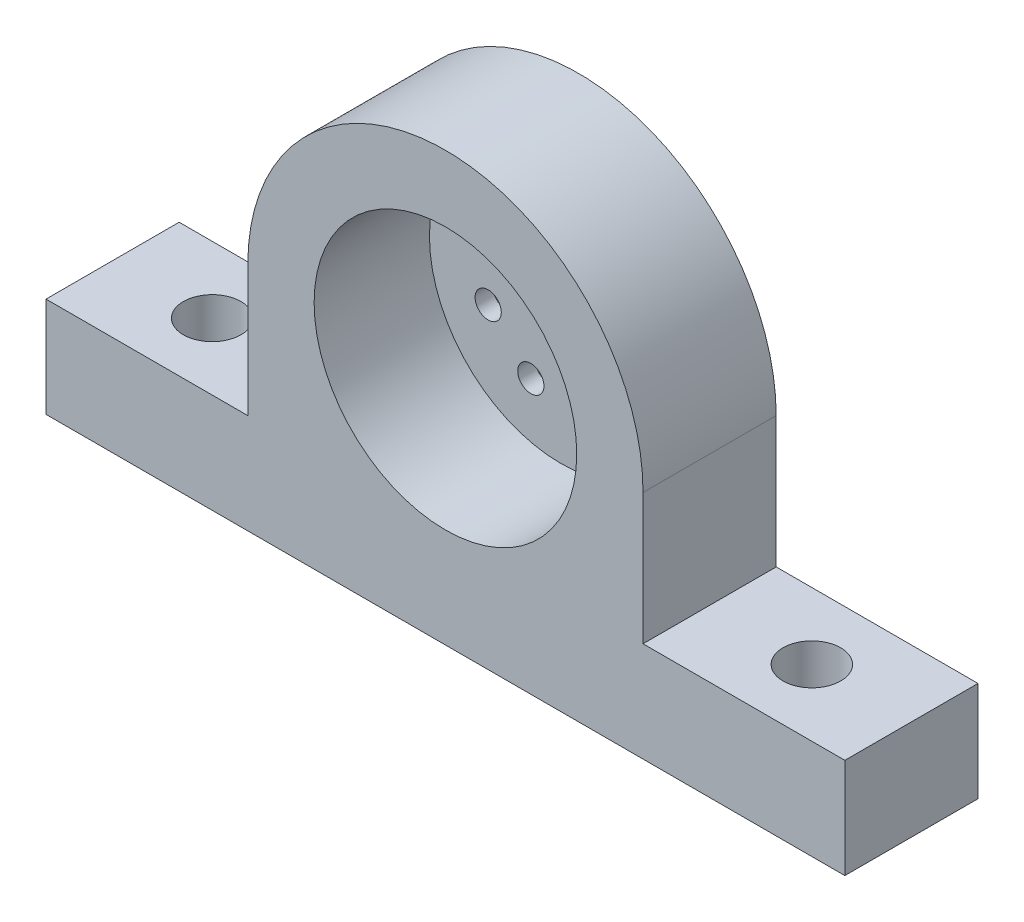
ISO-10303-21;
HEADER;
FILE_DESCRIPTION(('STEP AP214'),'2;1');
FILE_NAME('part.step','',(''),(''),'','','');
FILE_SCHEMA(('AUTOMOTIVE_DESIGN { 1 0 10303 214 1 1 1 1 }'));
ENDSEC;
DATA;
#1=APPLICATION_CONTEXT('core data for automotive mechanical design processes');
#2=APPLICATION_PROTOCOL_DEFINITION('international standard','automotive_design',2000,#1);
#3=PRODUCT_CONTEXT('',#1,'mechanical');
#4=PRODUCT('Part','Part','',(#3));
#5=PRODUCT_RELATED_PRODUCT_CATEGORY('part','',(#4));
#6=PRODUCT_DEFINITION_FORMATION('','',#4);
#7=PRODUCT_DEFINITION_CONTEXT('part definition',#1,'design');
#8=PRODUCT_DEFINITION('design','',#6,#7);
#9=PRODUCT_DEFINITION_SHAPE('','',#8);
#10=(LENGTH_UNIT() NAMED_UNIT(*) SI_UNIT(.MILLI.,.METRE.));
#11=(NAMED_UNIT(*) PLANE_ANGLE_UNIT() SI_UNIT($,.RADIAN.));
#12=(NAMED_UNIT(*) SI_UNIT($,.STERADIAN.) SOLID_ANGLE_UNIT());
#13=UNCERTAINTY_MEASURE_WITH_UNIT(LENGTH_MEASURE(1.E-05),#10,'distance_accuracy_value','');
#14=(GEOMETRIC_REPRESENTATION_CONTEXT(3) GLOBAL_UNCERTAINTY_ASSIGNED_CONTEXT((#13)) GLOBAL_UNIT_ASSIGNED_CONTEXT((#10,
#11,#12)) REPRESENTATION_CONTEXT('',''));
#15=CARTESIAN_POINT('',(0.,0.,0.));
#16=DIRECTION('',(0.,0.,1.));
#17=DIRECTION('',(1.,0.,0.));
#18=AXIS2_PLACEMENT_3D('',#15,#16,#17);
#19=CARTESIAN_POINT('',(0.,0.,25.4));
#20=DIRECTION('',(0.,0.,-1.));
#21=DIRECTION('',(-1.,0.,0.));
#22=AXIS2_PLACEMENT_3D('',#19,#20,#21);
#23=CYLINDRICAL_SURFACE('',#22,4.);
#24=CARTESIAN_POINT('',(0.,0.,0.));
#25=DIRECTION('',(0.,0.,1.));
#26=DIRECTION('',(1.,0.,0.));
#27=AXIS2_PLACEMENT_3D('',#24,#25,#26);
#28=CIRCLE('',#27,4.);
#29=CARTESIAN_POINT('',(4.,0.,0.));
#30=VERTEX_POINT('',#29);
#31=EDGE_CURVE('E347',#30,#30,#28,.T.);
#32=ORIENTED_EDGE('',*,*,#31,.F.);
#33=EDGE_LOOP('',(#32));
#34=FACE_BOUND('',#33,.T.);
#35=CARTESIAN_POINT('',(0.,0.,3.4));
#36=DIRECTION('',(0.,0.,1.));
#37=DIRECTION('',(1.,0.,0.));
#38=AXIS2_PLACEMENT_3D('',#35,#36,#37);
#39=CIRCLE('',#38,4.);
#40=CARTESIAN_POINT('',(4.,0.,3.4));
#41=VERTEX_POINT('',#40);
#42=EDGE_CURVE('E351',#41,#41,#39,.T.);
#43=ORIENTED_EDGE('',*,*,#42,.T.);
#44=EDGE_LOOP('',(#43));
#45=FACE_BOUND('',#44,.T.);
#46=ADVANCED_FACE('F249',(#34,#45),#23,.F.);
#47=CARTESIAN_POINT('',(0.,0.,25.4));
#48=DIRECTION('',(0.,0.,-1.));
#49=DIRECTION('',(-1.,0.,0.));
#50=AXIS2_PLACEMENT_3D('',#47,#48,#49);
#51=CYLINDRICAL_SURFACE('',#50,37.7);
#52=CARTESIAN_POINT('',(0.,0.,0.));
#53=DIRECTION('',(0.,0.,1.));
#54=DIRECTION('',(1.,0.,0.));
#55=AXIS2_PLACEMENT_3D('',#52,#53,#54);
#56=CIRCLE('',#55,37.7);
#57=CARTESIAN_POINT('',(-37.7,0.,0.));
#58=VERTEX_POINT('',#57);
#59=CARTESIAN_POINT('',(37.7,0.,0.));
#60=VERTEX_POINT('',#59);
#61=EDGE_CURVE('E353',#58,#60,#56,.F.);
#62=ORIENTED_EDGE('',*,*,#61,.F.);
#63=DIRECTION('',(0.,0.,-1.));
#64=VECTOR('',#63,1.);
#65=CARTESIAN_POINT('',(-37.7,0.,25.4));
#66=LINE('',#65,#64);
#67=CARTESIAN_POINT('',(-37.7,0.,25.4));
#68=VERTEX_POINT('',#67);
#69=EDGE_CURVE('E258',#68,#58,#66,.T.);
#70=ORIENTED_EDGE('',*,*,#69,.F.);
#71=CARTESIAN_POINT('',(0.,0.,25.4));
#72=DIRECTION('',(0.,0.,1.));
#73=DIRECTION('',(1.,0.,0.));
#74=AXIS2_PLACEMENT_3D('',#71,#72,#73);
#75=CIRCLE('',#74,37.7);
#76=CARTESIAN_POINT('',(37.7,0.,25.4));
#77=VERTEX_POINT('',#76);
#78=EDGE_CURVE('E446',#68,#77,#75,.F.);
#79=ORIENTED_EDGE('',*,*,#78,.T.);
#80=DIRECTION('',(0.,0.,-1.));
#81=VECTOR('',#80,1.);
#82=CARTESIAN_POINT('',(37.7,0.,25.4));
#83=LINE('',#82,#81);
#84=EDGE_CURVE('E12',#77,#60,#83,.T.);
#85=ORIENTED_EDGE('',*,*,#84,.T.);
#86=EDGE_LOOP('',(#62,#70,#79,#85));
#87=FACE_BOUND('',#86,.T.);
#88=ADVANCED_FACE('F476',(#87),#51,.T.);
#89=CARTESIAN_POINT('',(-37.7,0.,25.4));
#90=DIRECTION('',(-1.,0.,0.));
#91=DIRECTION('',(0.,0.,1.));
#92=AXIS2_PLACEMENT_3D('',#89,#90,#91);
#93=PLANE('',#92);
#94=DIRECTION('',(0.,1.,0.));
#95=VECTOR('',#94,1.);
#96=CARTESIAN_POINT('',(-37.7,0.,0.));
#97=LINE('',#96,#95);
#98=CARTESIAN_POINT('',(-37.7,-25.,0.));
#99=VERTEX_POINT('',#98);
#100=EDGE_CURVE('E356',#99,#58,#97,.T.);
#101=ORIENTED_EDGE('',*,*,#100,.F.);
#102=DIRECTION('',(0.,0.,-1.));
#103=VECTOR('',#102,1.);
#104=CARTESIAN_POINT('',(-37.7,-25.,25.4));
#105=LINE('',#104,#103);
#106=CARTESIAN_POINT('',(-37.7,-25.,25.4));
#107=VERTEX_POINT('',#106);
#108=EDGE_CURVE('E374',#107,#99,#105,.T.);
#109=ORIENTED_EDGE('',*,*,#108,.F.);
#110=DIRECTION('',(0.,1.,0.));
#111=VECTOR('',#110,1.);
#112=CARTESIAN_POINT('',(-37.7,0.,25.4));
#113=LINE('',#112,#111);
#114=EDGE_CURVE('E449',#107,#68,#113,.T.);
#115=ORIENTED_EDGE('',*,*,#114,.T.);
#116=ORIENTED_EDGE('',*,*,#69,.T.);
#117=EDGE_LOOP('',(#101,#109,#115,#116));
#118=FACE_BOUND('',#117,.T.);
#119=ADVANCED_FACE('F473',(#118),#93,.T.);
#120=CARTESIAN_POINT('',(0.,-25.,25.4));
#121=DIRECTION('',(0.,1.,0.));
#122=DIRECTION('',(0.,0.,1.));
#123=AXIS2_PLACEMENT_3D('',#120,#121,#122);
#124=PLANE('',#123);
#125=CARTESIAN_POINT('',(-57.2,-25.,12.7));
#126=DIRECTION('',(0.,1.,0.));
#127=DIRECTION('',(0.,0.,1.));
#128=AXIS2_PLACEMENT_3D('',#125,#126,#127);
#129=CIRCLE('',#128,5.5);
#130=CARTESIAN_POINT('',(-57.2,-25.,18.2));
#131=VERTEX_POINT('',#130);
#132=EDGE_CURVE('E383',#131,#131,#129,.T.);
#133=ORIENTED_EDGE('',*,*,#132,.F.);
#134=EDGE_LOOP('',(#133));
#135=FACE_BOUND('',#134,.T.);
#136=DIRECTION('',(1.,0.,0.));
#137=VECTOR('',#136,1.);
#138=CARTESIAN_POINT('',(0.,-25.,0.));
#139=LINE('',#138,#137);
#140=CARTESIAN_POINT('',(-76.2,-25.,0.));
#141=VERTEX_POINT('',#140);
#142=EDGE_CURVE('E359',#141,#99,#139,.T.);
#143=ORIENTED_EDGE('',*,*,#142,.F.);
#144=DIRECTION('',(0.,0.,-1.));
#145=VECTOR('',#144,1.);
#146=CARTESIAN_POINT('',(-76.2,-25.,25.4));
#147=LINE('',#146,#145);
#148=CARTESIAN_POINT('',(-76.2,-25.,25.4));
#149=VERTEX_POINT('',#148);
#150=EDGE_CURVE('E372',#149,#141,#147,.T.);
#151=ORIENTED_EDGE('',*,*,#150,.F.);
#152=DIRECTION('',(1.,0.,0.));
#153=VECTOR('',#152,1.);
#154=CARTESIAN_POINT('',(0.,-25.,25.4));
#155=LINE('',#154,#153);
#156=EDGE_CURVE('E344',#149,#107,#155,.T.);
#157=ORIENTED_EDGE('',*,*,#156,.T.);
#158=ORIENTED_EDGE('',*,*,#108,.T.);
#159=EDGE_LOOP('',(#143,#151,#157,#158));
#160=FACE_BOUND('',#159,.T.);
#161=ADVANCED_FACE('F464',(#135,#160),#124,.T.);
#162=CARTESIAN_POINT('',(-76.2,0.,25.4));
#163=DIRECTION('',(-1.,0.,0.));
#164=DIRECTION('',(0.,0.,1.));
#165=AXIS2_PLACEMENT_3D('',#162,#163,#164);
#166=PLANE('',#165);
#167=DIRECTION('',(0.,1.,0.));
#168=VECTOR('',#167,1.);
#169=CARTESIAN_POINT('',(-76.2,0.,0.));
#170=LINE('',#169,#168);
#171=CARTESIAN_POINT('',(-76.2,-44.05,0.));
#172=VERTEX_POINT('',#171);
#173=EDGE_CURVE('E362',#172,#141,#170,.T.);
#174=ORIENTED_EDGE('',*,*,#173,.F.);
#175=DIRECTION('',(0.,0.,-1.));
#176=VECTOR('',#175,1.);
#177=CARTESIAN_POINT('',(-76.2,-44.05,25.4));
#178=LINE('',#177,#176);
#179=CARTESIAN_POINT('',(-76.2,-44.05,25.4));
#180=VERTEX_POINT('',#179);
#181=EDGE_CURVE('E338',#180,#172,#178,.T.);
#182=ORIENTED_EDGE('',*,*,#181,.F.);
#183=DIRECTION('',(0.,1.,0.));
#184=VECTOR('',#183,1.);
#185=CARTESIAN_POINT('',(-76.2,0.,25.4));
#186=LINE('',#185,#184);
#187=EDGE_CURVE('E328',#180,#149,#186,.T.);
#188=ORIENTED_EDGE('',*,*,#187,.T.);
#189=ORIENTED_EDGE('',*,*,#150,.T.);
#190=EDGE_LOOP('',(#174,#182,#188,#189));
#191=FACE_BOUND('',#190,.T.);
#192=ADVANCED_FACE('F454',(#191),#166,.T.);
#193=CARTESIAN_POINT('',(0.,-44.05,25.4));
#194=DIRECTION('',(0.,1.,0.));
#195=DIRECTION('',(0.,0.,1.));
#196=AXIS2_PLACEMENT_3D('',#193,#194,#195);
#197=PLANE('',#196);
#198=CARTESIAN_POINT('',(-57.2,-44.05,12.7));
#199=DIRECTION('',(0.,1.,0.));
#200=DIRECTION('',(0.,0.,1.));
#201=AXIS2_PLACEMENT_3D('',#198,#199,#200);
#202=CIRCLE('',#201,5.49999999999999);
#203=CARTESIAN_POINT('',(-57.2,-44.05,18.2));
#204=VERTEX_POINT('',#203);
#205=EDGE_CURVE('E431',#204,#204,#202,.T.);
#206=ORIENTED_EDGE('',*,*,#205,.T.);
#207=EDGE_LOOP('',(#206));
#208=FACE_BOUND('',#207,.T.);
#209=CARTESIAN_POINT('',(57.2,-44.05,12.7));
#210=DIRECTION('',(0.,1.,0.));
#211=DIRECTION('',(0.,0.,1.));
#212=AXIS2_PLACEMENT_3D('',#209,#210,#211);
#213=CIRCLE('',#212,5.49999999999999);
#214=CARTESIAN_POINT('',(57.2,-44.05,18.2));
#215=VERTEX_POINT('',#214);
#216=EDGE_CURVE('E437',#215,#215,#213,.T.);
#217=ORIENTED_EDGE('',*,*,#216,.T.);
#218=EDGE_LOOP('',(#217));
#219=FACE_BOUND('',#218,.T.);
#220=DIRECTION('',(1.,0.,0.));
#221=VECTOR('',#220,1.);
#222=CARTESIAN_POINT('',(0.,-44.05,0.));
#223=LINE('',#222,#221);
#224=CARTESIAN_POINT('',(76.2,-44.05,0.));
#225=VERTEX_POINT('',#224);
#226=EDGE_CURVE('E335',#172,#225,#223,.T.);
#227=ORIENTED_EDGE('',*,*,#226,.T.);
#228=DIRECTION('',(0.,0.,-1.));
#229=VECTOR('',#228,1.);
#230=CARTESIAN_POINT('',(76.2,-44.05,25.4));
#231=LINE('',#230,#229);
#232=CARTESIAN_POINT('',(76.2,-44.05,25.4));
#233=VERTEX_POINT('',#232);
#234=EDGE_CURVE('E332',#233,#225,#231,.T.);
#235=ORIENTED_EDGE('',*,*,#234,.F.);
#236=DIRECTION('',(1.,0.,0.));
#237=VECTOR('',#236,1.);
#238=CARTESIAN_POINT('',(0.,-44.05,25.4));
#239=LINE('',#238,#237);
#240=EDGE_CURVE('E321',#180,#233,#239,.T.);
#241=ORIENTED_EDGE('',*,*,#240,.F.);
#242=ORIENTED_EDGE('',*,*,#181,.T.);
#243=EDGE_LOOP('',(#227,#235,#241,#242));
#244=FACE_BOUND('',#243,.T.);
#245=ADVANCED_FACE('F333',(#208,#219,#244),#197,.F.);
#246=CARTESIAN_POINT('',(76.2,0.,25.4));
#247=DIRECTION('',(-1.,0.,0.));
#248=DIRECTION('',(0.,0.,1.));
#249=AXIS2_PLACEMENT_3D('',#246,#247,#248);
#250=PLANE('',#249);
#251=DIRECTION('',(0.,1.,0.));
#252=VECTOR('',#251,1.);
#253=CARTESIAN_POINT('',(76.2,0.,0.));
#254=LINE('',#253,#252);
#255=CARTESIAN_POINT('',(76.2,-25.,0.));
#256=VERTEX_POINT('',#255);
#257=EDGE_CURVE('E367',#225,#256,#254,.T.);
#258=ORIENTED_EDGE('',*,*,#257,.T.);
#259=DIRECTION('',(0.,0.,-1.));
#260=VECTOR('',#259,1.);
#261=CARTESIAN_POINT('',(76.2,-25.,25.4));
#262=LINE('',#261,#260);
#263=CARTESIAN_POINT('',(76.2,-25.,25.4));
#264=VERTEX_POINT('',#263);
#265=EDGE_CURVE('E293',#264,#256,#262,.T.);
#266=ORIENTED_EDGE('',*,*,#265,.F.);
#267=DIRECTION('',(0.,1.,0.));
#268=VECTOR('',#267,1.);
#269=CARTESIAN_POINT('',(76.2,0.,25.4));
#270=LINE('',#269,#268);
#271=EDGE_CURVE('E325',#233,#264,#270,.T.);
#272=ORIENTED_EDGE('',*,*,#271,.F.);
#273=ORIENTED_EDGE('',*,*,#234,.T.);
#274=EDGE_LOOP('',(#258,#266,#272,#273));
#275=FACE_BOUND('',#274,.T.);
#276=ADVANCED_FACE('F340',(#275),#250,.F.);
#277=CARTESIAN_POINT('',(57.2,-25.,12.7));
#278=DIRECTION('',(0.,1.,0.));
#279=DIRECTION('',(0.,0.,1.));
#280=AXIS2_PLACEMENT_3D('',#277,#278,#279);
#281=CIRCLE('',#280,5.49999999999999);
#282=CARTESIAN_POINT('',(57.2,-25.,18.2));
#283=VERTEX_POINT('',#282);
#284=EDGE_CURVE('E434',#283,#283,#281,.T.);
#285=ORIENTED_EDGE('',*,*,#284,.F.);
#286=EDGE_LOOP('',(#285));
#287=FACE_BOUND('',#286,.T.);
#288=CARTESIAN_POINT('',(37.7,-25.,0.));
#289=VERTEX_POINT('',#288);
#290=EDGE_CURVE('E363',#289,#256,#139,.T.);
#291=ORIENTED_EDGE('',*,*,#290,.F.);
#292=DIRECTION('',(0.,0.,-1.));
#293=VECTOR('',#292,1.);
#294=CARTESIAN_POINT('',(37.7,-25.,25.4));
#295=LINE('',#294,#293);
#296=CARTESIAN_POINT('',(37.7,-25.,25.4));
#297=VERTEX_POINT('',#296);
#298=EDGE_CURVE('E267',#297,#289,#295,.T.);
#299=ORIENTED_EDGE('',*,*,#298,.F.);
#300=EDGE_CURVE('E341',#297,#264,#155,.T.);
#301=ORIENTED_EDGE('',*,*,#300,.T.);
#302=ORIENTED_EDGE('',*,*,#265,.T.);
#303=EDGE_LOOP('',(#291,#299,#301,#302));
#304=FACE_BOUND('',#303,.T.);
#305=ADVANCED_FACE('F459',(#287,#304),#124,.T.);
#306=CARTESIAN_POINT('',(37.7,0.,25.4));
#307=DIRECTION('',(-1.,0.,0.));
#308=DIRECTION('',(0.,0.,1.));
#309=AXIS2_PLACEMENT_3D('',#306,#307,#308);
#310=PLANE('',#309);
#311=DIRECTION('',(0.,1.,0.));
#312=VECTOR('',#311,1.);
#313=CARTESIAN_POINT('',(37.7,0.,0.));
#314=LINE('',#313,#312);
#315=EDGE_CURVE('E350',#289,#60,#314,.T.);
#316=ORIENTED_EDGE('',*,*,#315,.T.);
#317=ORIENTED_EDGE('',*,*,#84,.F.);
#318=DIRECTION('',(0.,1.,0.));
#319=VECTOR('',#318,1.);
#320=CARTESIAN_POINT('',(37.7,0.,25.4));
#321=LINE('',#320,#319);
#322=EDGE_CURVE('E305',#297,#77,#321,.T.);
#323=ORIENTED_EDGE('',*,*,#322,.F.);
#324=ORIENTED_EDGE('',*,*,#298,.T.);
#325=EDGE_LOOP('',(#316,#317,#323,#324));
#326=FACE_BOUND('',#325,.T.);
#327=ADVANCED_FACE('F461',(#326),#310,.F.);
#328=CARTESIAN_POINT('',(0.,0.,0.));
#329=DIRECTION('',(0.,0.,1.));
#330=DIRECTION('',(1.,0.,0.));
#331=AXIS2_PLACEMENT_3D('',#328,#329,#330);
#332=PLANE('',#331);
#333=CARTESIAN_POINT('',(-13.8725997792633,5.70534620898535,0.));
#334=DIRECTION('',(0.,0.,-1.));
#335=DIRECTION('',(-1.,0.,0.));
#336=AXIS2_PLACEMENT_3D('',#333,#334,#335);
#337=CIRCLE('',#336,2.5);
#338=CARTESIAN_POINT('',(-16.3725997792633,5.70534620898535,0.));
#339=VERTEX_POINT('',#338);
#340=EDGE_CURVE('E416',#339,#339,#337,.T.);
#341=ORIENTED_EDGE('',*,*,#340,.F.);
#342=EDGE_LOOP('',(#341));
#343=FACE_BOUND('',#342,.T.);
#344=CARTESIAN_POINT('',(-13.8436983699948,-5.77512038321358,0.));
#345=DIRECTION('',(0.,0.,-1.));
#346=DIRECTION('',(-1.,0.,0.));
#347=AXIS2_PLACEMENT_3D('',#344,#345,#346);
#348=CIRCLE('',#347,2.5);
#349=CARTESIAN_POINT('',(-16.3436983699948,-5.77512038321358,0.));
#350=VERTEX_POINT('',#349);
#351=EDGE_CURVE('E406',#350,#350,#348,.T.);
#352=ORIENTED_EDGE('',*,*,#351,.F.);
#353=EDGE_LOOP('',(#352));
#354=FACE_BOUND('',#353,.T.);
#355=CARTESIAN_POINT('',(-5.70534620898581,-13.8725997792631,0.));
#356=DIRECTION('',(0.,0.,-1.));
#357=DIRECTION('',(-1.,0.,0.));
#358=AXIS2_PLACEMENT_3D('',#355,#356,#357);
#359=CIRCLE('',#358,2.5);
#360=CARTESIAN_POINT('',(-8.20534620898581,-13.8725997792631,0.));
#361=VERTEX_POINT('',#360);
#362=EDGE_CURVE('E403',#361,#361,#359,.T.);
#363=ORIENTED_EDGE('',*,*,#362,.F.);
#364=EDGE_LOOP('',(#363));
#365=FACE_BOUND('',#364,.T.);
#366=CARTESIAN_POINT('',(5.77512038321315,-13.8436983699948,0.));
#367=DIRECTION('',(0.,0.,-1.));
#368=DIRECTION('',(-1.,0.,0.));
#369=AXIS2_PLACEMENT_3D('',#366,#367,#368);
#370=CIRCLE('',#369,2.5);
#371=CARTESIAN_POINT('',(3.27512038321316,-13.8436983699948,0.));
#372=VERTEX_POINT('',#371);
#373=EDGE_CURVE('E400',#372,#372,#370,.T.);
#374=ORIENTED_EDGE('',*,*,#373,.F.);
#375=EDGE_LOOP('',(#374));
#376=FACE_BOUND('',#375,.T.);
#377=CARTESIAN_POINT('',(13.8725997792631,-5.70534620898575,0.));
#378=DIRECTION('',(0.,0.,-1.));
#379=DIRECTION('',(-1.,0.,0.));
#380=AXIS2_PLACEMENT_3D('',#377,#378,#379);
#381=CIRCLE('',#380,2.5);
#382=CARTESIAN_POINT('',(11.3725997792631,-5.70534620898575,0.));
#383=VERTEX_POINT('',#382);
#384=EDGE_CURVE('E396',#383,#383,#381,.T.);
#385=ORIENTED_EDGE('',*,*,#384,.F.);
#386=EDGE_LOOP('',(#385));
#387=FACE_BOUND('',#386,.T.);
#388=CARTESIAN_POINT('',(13.8436983699948,5.77512038321302,0.));
#389=DIRECTION('',(0.,0.,-1.));
#390=DIRECTION('',(-1.,0.,0.));
#391=AXIS2_PLACEMENT_3D('',#388,#389,#390);
#392=CIRCLE('',#391,2.5);
#393=CARTESIAN_POINT('',(11.3436983699948,5.77512038321302,0.));
#394=VERTEX_POINT('',#393);
#395=EDGE_CURVE('E392',#394,#394,#392,.T.);
#396=ORIENTED_EDGE('',*,*,#395,.F.);
#397=EDGE_LOOP('',(#396));
#398=FACE_BOUND('',#397,.T.);
#399=CARTESIAN_POINT('',(5.70534620898546,13.872599779263,0.));
#400=DIRECTION('',(0.,0.,-1.));
#401=DIRECTION('',(-1.,0.,0.));
#402=AXIS2_PLACEMENT_3D('',#399,#400,#401);
#403=CIRCLE('',#402,2.49999999999999);
#404=CARTESIAN_POINT('',(3.20534620898546,13.872599779263,0.));
#405=VERTEX_POINT('',#404);
#406=EDGE_CURVE('E388',#405,#405,#403,.T.);
#407=ORIENTED_EDGE('',*,*,#406,.F.);
#408=EDGE_LOOP('',(#407));
#409=FACE_BOUND('',#408,.T.);
#410=CARTESIAN_POINT('',(-5.77512038321348,13.8436983699945,0.));
#411=DIRECTION('',(0.,0.,-1.));
#412=DIRECTION('',(-1.,0.,0.));
#413=AXIS2_PLACEMENT_3D('',#410,#411,#412);
#414=CIRCLE('',#413,2.5);
#415=CARTESIAN_POINT('',(-8.27512038321348,13.8436983699945,0.));
#416=VERTEX_POINT('',#415);
#417=EDGE_CURVE('E384',#416,#416,#414,.T.);
#418=ORIENTED_EDGE('',*,*,#417,.F.);
#419=EDGE_LOOP('',(#418));
#420=FACE_BOUND('',#419,.T.);
#421=ORIENTED_EDGE('',*,*,#31,.T.);
#422=EDGE_LOOP('',(#421));
#423=FACE_BOUND('',#422,.T.);
#424=ORIENTED_EDGE('',*,*,#315,.F.);
#425=ORIENTED_EDGE('',*,*,#290,.T.);
#426=ORIENTED_EDGE('',*,*,#257,.F.);
#427=ORIENTED_EDGE('',*,*,#226,.F.);
#428=ORIENTED_EDGE('',*,*,#173,.T.);
#429=ORIENTED_EDGE('',*,*,#142,.T.);
#430=ORIENTED_EDGE('',*,*,#100,.T.);
#431=ORIENTED_EDGE('',*,*,#61,.T.);
#432=EDGE_LOOP('',(#424,#425,#426,#427,#428,#429,#430,#431));
#433=FACE_BOUND('',#432,.T.);
#434=ADVANCED_FACE('F457',(#343,#354,#365,#376,#387,#398,#409,#420,#423,#433),#332,.F.);
#435=CARTESIAN_POINT('',(0.,0.,25.4));
#436=DIRECTION('',(0.,0.,1.));
#437=DIRECTION('',(1.,0.,0.));
#438=AXIS2_PLACEMENT_3D('',#435,#436,#437);
#439=PLANE('',#438);
#440=CARTESIAN_POINT('',(0.,0.,25.4));
#441=DIRECTION('',(0.,0.,1.));
#442=DIRECTION('',(1.,0.,0.));
#443=AXIS2_PLACEMENT_3D('',#440,#441,#442);
#444=CIRCLE('',#443,25.05);
#445=CARTESIAN_POINT('',(25.05,0.,25.4));
#446=VERTEX_POINT('',#445);
#447=EDGE_CURVE('E440',#446,#446,#444,.T.);
#448=ORIENTED_EDGE('',*,*,#447,.F.);
#449=EDGE_LOOP('',(#448));
#450=FACE_BOUND('',#449,.T.);
#451=ORIENTED_EDGE('',*,*,#322,.T.);
#452=ORIENTED_EDGE('',*,*,#78,.F.);
#453=ORIENTED_EDGE('',*,*,#114,.F.);
#454=ORIENTED_EDGE('',*,*,#156,.F.);
#455=ORIENTED_EDGE('',*,*,#187,.F.);
#456=ORIENTED_EDGE('',*,*,#240,.T.);
#457=ORIENTED_EDGE('',*,*,#271,.T.);
#458=ORIENTED_EDGE('',*,*,#300,.F.);
#459=EDGE_LOOP('',(#451,#452,#453,#454,#455,#456,#457,#458));
#460=FACE_BOUND('',#459,.T.);
#461=ADVANCED_FACE('F323',(#450,#460),#439,.T.);
#462=CARTESIAN_POINT('',(0.,0.,3.4));
#463=DIRECTION('',(0.,0.,1.));
#464=DIRECTION('',(1.,0.,0.));
#465=AXIS2_PLACEMENT_3D('',#462,#463,#464);
#466=CYLINDRICAL_SURFACE('',#465,25.05);
#467=CARTESIAN_POINT('',(0.,0.,3.4));
#468=DIRECTION('',(0.,0.,1.));
#469=DIRECTION('',(1.,0.,0.));
#470=AXIS2_PLACEMENT_3D('',#467,#468,#469);
#471=CIRCLE('',#470,25.05);
#472=CARTESIAN_POINT('',(25.05,0.,3.4));
#473=VERTEX_POINT('',#472);
#474=EDGE_CURVE('E379',#473,#473,#471,.T.);
#475=ORIENTED_EDGE('',*,*,#474,.F.);
#476=EDGE_LOOP('',(#475));
#477=FACE_BOUND('',#476,.T.);
#478=ORIENTED_EDGE('',*,*,#447,.T.);
#479=EDGE_LOOP('',(#478));
#480=FACE_BOUND('',#479,.T.);
#481=ADVANCED_FACE('F491',(#477,#480),#466,.F.);
#482=CARTESIAN_POINT('',(0.,0.,3.4));
#483=DIRECTION('',(0.,0.,1.));
#484=DIRECTION('',(1.,0.,0.));
#485=AXIS2_PLACEMENT_3D('',#482,#483,#484);
#486=PLANE('',#485);
#487=CARTESIAN_POINT('',(-13.8725997792633,5.70534620898535,3.4));
#488=DIRECTION('',(0.,0.,1.));
#489=DIRECTION('',(1.,0.,0.));
#490=AXIS2_PLACEMENT_3D('',#487,#488,#489);
#491=CIRCLE('',#490,2.5);
#492=CARTESIAN_POINT('',(-11.3725997792633,5.70534620898535,3.4));
#493=VERTEX_POINT('',#492);
#494=EDGE_CURVE('E252',#493,#493,#491,.T.);
#495=ORIENTED_EDGE('',*,*,#494,.F.);
#496=EDGE_LOOP('',(#495));
#497=FACE_BOUND('',#496,.T.);
#498=CARTESIAN_POINT('',(-13.8436983699948,-5.77512038321358,3.4));
#499=DIRECTION('',(0.,0.,1.));
#500=DIRECTION('',(1.,0.,0.));
#501=AXIS2_PLACEMENT_3D('',#498,#499,#500);
#502=CIRCLE('',#501,2.5);
#503=CARTESIAN_POINT('',(-11.3436983699948,-5.77512038321358,3.4));
#504=VERTEX_POINT('',#503);
#505=EDGE_CURVE('E404',#504,#504,#502,.T.);
#506=ORIENTED_EDGE('',*,*,#505,.F.);
#507=EDGE_LOOP('',(#506));
#508=FACE_BOUND('',#507,.T.);
#509=CARTESIAN_POINT('',(-5.70534620898581,-13.8725997792631,3.4));
#510=DIRECTION('',(0.,0.,1.));
#511=DIRECTION('',(1.,0.,0.));
#512=AXIS2_PLACEMENT_3D('',#509,#510,#511);
#513=CIRCLE('',#512,2.5);
#514=CARTESIAN_POINT('',(-3.20534620898581,-13.8725997792631,3.4));
#515=VERTEX_POINT('',#514);
#516=EDGE_CURVE('E401',#515,#515,#513,.T.);
#517=ORIENTED_EDGE('',*,*,#516,.F.);
#518=EDGE_LOOP('',(#517));
#519=FACE_BOUND('',#518,.T.);
#520=CARTESIAN_POINT('',(5.77512038321315,-13.8436983699948,3.4));
#521=DIRECTION('',(0.,0.,1.));
#522=DIRECTION('',(1.,0.,0.));
#523=AXIS2_PLACEMENT_3D('',#520,#521,#522);
#524=CIRCLE('',#523,2.5);
#525=CARTESIAN_POINT('',(8.27512038321315,-13.8436983699948,3.4));
#526=VERTEX_POINT('',#525);
#527=EDGE_CURVE('E397',#526,#526,#524,.T.);
#528=ORIENTED_EDGE('',*,*,#527,.F.);
#529=EDGE_LOOP('',(#528));
#530=FACE_BOUND('',#529,.T.);
#531=CARTESIAN_POINT('',(13.8725997792631,-5.70534620898575,3.4));
#532=DIRECTION('',(0.,0.,1.));
#533=DIRECTION('',(1.,0.,0.));
#534=AXIS2_PLACEMENT_3D('',#531,#532,#533);
#535=CIRCLE('',#534,2.5);
#536=CARTESIAN_POINT('',(16.3725997792631,-5.70534620898575,3.4));
#537=VERTEX_POINT('',#536);
#538=EDGE_CURVE('E393',#537,#537,#535,.T.);
#539=ORIENTED_EDGE('',*,*,#538,.F.);
#540=EDGE_LOOP('',(#539));
#541=FACE_BOUND('',#540,.T.);
#542=CARTESIAN_POINT('',(13.8436983699948,5.77512038321302,3.4));
#543=DIRECTION('',(0.,0.,1.));
#544=DIRECTION('',(1.,0.,0.));
#545=AXIS2_PLACEMENT_3D('',#542,#543,#544);
#546=CIRCLE('',#545,2.5);
#547=CARTESIAN_POINT('',(16.3436983699948,5.77512038321302,3.4));
#548=VERTEX_POINT('',#547);
#549=EDGE_CURVE('E389',#548,#548,#546,.T.);
#550=ORIENTED_EDGE('',*,*,#549,.F.);
#551=EDGE_LOOP('',(#550));
#552=FACE_BOUND('',#551,.T.);
#553=CARTESIAN_POINT('',(5.70534620898546,13.872599779263,3.4));
#554=DIRECTION('',(0.,0.,1.));
#555=DIRECTION('',(1.,0.,0.));
#556=AXIS2_PLACEMENT_3D('',#553,#554,#555);
#557=CIRCLE('',#556,2.49999999999999);
#558=CARTESIAN_POINT('',(8.20534620898545,13.872599779263,3.4));
#559=VERTEX_POINT('',#558);
#560=EDGE_CURVE('E385',#559,#559,#557,.T.);
#561=ORIENTED_EDGE('',*,*,#560,.F.);
#562=EDGE_LOOP('',(#561));
#563=FACE_BOUND('',#562,.T.);
#564=CARTESIAN_POINT('',(-5.77512038321348,13.8436983699945,3.4));
#565=DIRECTION('',(0.,0.,1.));
#566=DIRECTION('',(1.,0.,0.));
#567=AXIS2_PLACEMENT_3D('',#564,#565,#566);
#568=CIRCLE('',#567,2.5);
#569=CARTESIAN_POINT('',(-3.27512038321349,13.8436983699945,3.4));
#570=VERTEX_POINT('',#569);
#571=EDGE_CURVE('E380',#570,#570,#568,.T.);
#572=ORIENTED_EDGE('',*,*,#571,.F.);
#573=EDGE_LOOP('',(#572));
#574=FACE_BOUND('',#573,.T.);
#575=ORIENTED_EDGE('',*,*,#42,.F.);
#576=EDGE_LOOP('',(#575));
#577=FACE_BOUND('',#576,.T.);
#578=ORIENTED_EDGE('',*,*,#474,.T.);
#579=EDGE_LOOP('',(#578));
#580=FACE_BOUND('',#579,.T.);
#581=ADVANCED_FACE('F487',(#497,#508,#519,#530,#541,#552,#563,#574,#577,#580),#486,.T.);
#582=CARTESIAN_POINT('',(57.2,-25.,12.7));
#583=DIRECTION('',(0.,1.,0.));
#584=DIRECTION('',(0.,0.,1.));
#585=AXIS2_PLACEMENT_3D('',#582,#583,#584);
#586=CYLINDRICAL_SURFACE('',#585,5.49999999999999);
#587=ORIENTED_EDGE('',*,*,#216,.F.);
#588=EDGE_LOOP('',(#587));
#589=FACE_BOUND('',#588,.T.);
#590=ORIENTED_EDGE('',*,*,#284,.T.);
#591=EDGE_LOOP('',(#590));
#592=FACE_BOUND('',#591,.T.);
#593=ADVANCED_FACE('F490',(#589,#592),#586,.F.);
#594=CARTESIAN_POINT('',(-57.2,-25.,12.7));
#595=DIRECTION('',(0.,1.,0.));
#596=DIRECTION('',(0.,0.,1.));
#597=AXIS2_PLACEMENT_3D('',#594,#595,#596);
#598=CYLINDRICAL_SURFACE('',#597,5.49999999999999);
#599=ORIENTED_EDGE('',*,*,#205,.F.);
#600=EDGE_LOOP('',(#599));
#601=FACE_BOUND('',#600,.T.);
#602=ORIENTED_EDGE('',*,*,#132,.T.);
#603=EDGE_LOOP('',(#602));
#604=FACE_BOUND('',#603,.T.);
#605=ADVANCED_FACE('F510',(#601,#604),#598,.F.);
#606=CARTESIAN_POINT('',(-5.77512038321348,13.8436983699945,10.));
#607=DIRECTION('',(0.,0.,-1.));
#608=DIRECTION('',(-1.,0.,0.));
#609=AXIS2_PLACEMENT_3D('',#606,#607,#608);
#610=CYLINDRICAL_SURFACE('',#609,2.5);
#611=ORIENTED_EDGE('',*,*,#571,.T.);
#612=EDGE_LOOP('',(#611));
#613=FACE_BOUND('',#612,.T.);
#614=ORIENTED_EDGE('',*,*,#417,.T.);
#615=EDGE_LOOP('',(#614));
#616=FACE_BOUND('',#615,.T.);
#617=ADVANCED_FACE('F514',(#613,#616),#610,.F.);
#618=CARTESIAN_POINT('',(5.70534620898546,13.872599779263,10.));
#619=DIRECTION('',(0.,0.,-1.));
#620=DIRECTION('',(-1.,0.,0.));
#621=AXIS2_PLACEMENT_3D('',#618,#619,#620);
#622=CYLINDRICAL_SURFACE('',#621,2.49999999999999);
#623=ORIENTED_EDGE('',*,*,#560,.T.);
#624=EDGE_LOOP('',(#623));
#625=FACE_BOUND('',#624,.T.);
#626=ORIENTED_EDGE('',*,*,#406,.T.);
#627=EDGE_LOOP('',(#626));
#628=FACE_BOUND('',#627,.T.);
#629=ADVANCED_FACE('F518',(#625,#628),#622,.F.);
#630=CARTESIAN_POINT('',(13.8436983699948,5.77512038321302,10.));
#631=DIRECTION('',(0.,0.,-1.));
#632=DIRECTION('',(-1.,0.,0.));
#633=AXIS2_PLACEMENT_3D('',#630,#631,#632);
#634=CYLINDRICAL_SURFACE('',#633,2.5);
#635=ORIENTED_EDGE('',*,*,#549,.T.);
#636=EDGE_LOOP('',(#635));
#637=FACE_BOUND('',#636,.T.);
#638=ORIENTED_EDGE('',*,*,#395,.T.);
#639=EDGE_LOOP('',(#638));
#640=FACE_BOUND('',#639,.T.);
#641=ADVANCED_FACE('F522',(#637,#640),#634,.F.);
#642=CARTESIAN_POINT('',(13.8725997792631,-5.70534620898575,10.));
#643=DIRECTION('',(0.,0.,-1.));
#644=DIRECTION('',(-1.,0.,0.));
#645=AXIS2_PLACEMENT_3D('',#642,#643,#644);
#646=CYLINDRICAL_SURFACE('',#645,2.5);
#647=ORIENTED_EDGE('',*,*,#538,.T.);
#648=EDGE_LOOP('',(#647));
#649=FACE_BOUND('',#648,.T.);
#650=ORIENTED_EDGE('',*,*,#384,.T.);
#651=EDGE_LOOP('',(#650));
#652=FACE_BOUND('',#651,.T.);
#653=ADVANCED_FACE('F526',(#649,#652),#646,.F.);
#654=CARTESIAN_POINT('',(5.77512038321315,-13.8436983699948,10.));
#655=DIRECTION('',(0.,0.,-1.));
#656=DIRECTION('',(-1.,0.,0.));
#657=AXIS2_PLACEMENT_3D('',#654,#655,#656);
#658=CYLINDRICAL_SURFACE('',#657,2.5);
#659=ORIENTED_EDGE('',*,*,#527,.T.);
#660=EDGE_LOOP('',(#659));
#661=FACE_BOUND('',#660,.T.);
#662=ORIENTED_EDGE('',*,*,#373,.T.);
#663=EDGE_LOOP('',(#662));
#664=FACE_BOUND('',#663,.T.);
#665=ADVANCED_FACE('F530',(#661,#664),#658,.F.);
#666=CARTESIAN_POINT('',(-5.70534620898581,-13.8725997792631,10.));
#667=DIRECTION('',(0.,0.,-1.));
#668=DIRECTION('',(-1.,0.,0.));
#669=AXIS2_PLACEMENT_3D('',#666,#667,#668);
#670=CYLINDRICAL_SURFACE('',#669,2.5);
#671=ORIENTED_EDGE('',*,*,#516,.T.);
#672=EDGE_LOOP('',(#671));
#673=FACE_BOUND('',#672,.T.);
#674=ORIENTED_EDGE('',*,*,#362,.T.);
#675=EDGE_LOOP('',(#674));
#676=FACE_BOUND('',#675,.T.);
#677=ADVANCED_FACE('F534',(#673,#676),#670,.F.);
#678=CARTESIAN_POINT('',(-13.8436983699948,-5.77512038321358,10.));
#679=DIRECTION('',(0.,0.,-1.));
#680=DIRECTION('',(-1.,0.,0.));
#681=AXIS2_PLACEMENT_3D('',#678,#679,#680);
#682=CYLINDRICAL_SURFACE('',#681,2.5);
#683=ORIENTED_EDGE('',*,*,#505,.T.);
#684=EDGE_LOOP('',(#683));
#685=FACE_BOUND('',#684,.T.);
#686=ORIENTED_EDGE('',*,*,#351,.T.);
#687=EDGE_LOOP('',(#686));
#688=FACE_BOUND('',#687,.T.);
#689=ADVANCED_FACE('F538',(#685,#688),#682,.F.);
#690=CARTESIAN_POINT('',(-13.8725997792633,5.70534620898535,10.));
#691=DIRECTION('',(0.,0.,-1.));
#692=DIRECTION('',(-1.,0.,0.));
#693=AXIS2_PLACEMENT_3D('',#690,#691,#692);
#694=CYLINDRICAL_SURFACE('',#693,2.5);
#695=ORIENTED_EDGE('',*,*,#494,.T.);
#696=EDGE_LOOP('',(#695));
#697=FACE_BOUND('',#696,.T.);
#698=ORIENTED_EDGE('',*,*,#340,.T.);
#699=EDGE_LOOP('',(#698));
#700=FACE_BOUND('',#699,.T.);
#701=ADVANCED_FACE('F542',(#697,#700),#694,.F.);
#702=CLOSED_SHELL('',(#46,#88,#119,#161,#192,#245,#276,#305,#327,#434,#461,#481,#581,#593,#605,
#617,#629,#641,#653,#665,#677,#689,#701));
#703=MANIFOLD_SOLID_BREP('B2',#702);
#704=ADVANCED_BREP_SHAPE_REPRESENTATION('',(#18,#703),#14);
#705=SHAPE_DEFINITION_REPRESENTATION(#9,#704);
ENDSEC;
END-ISO-10303-21;
